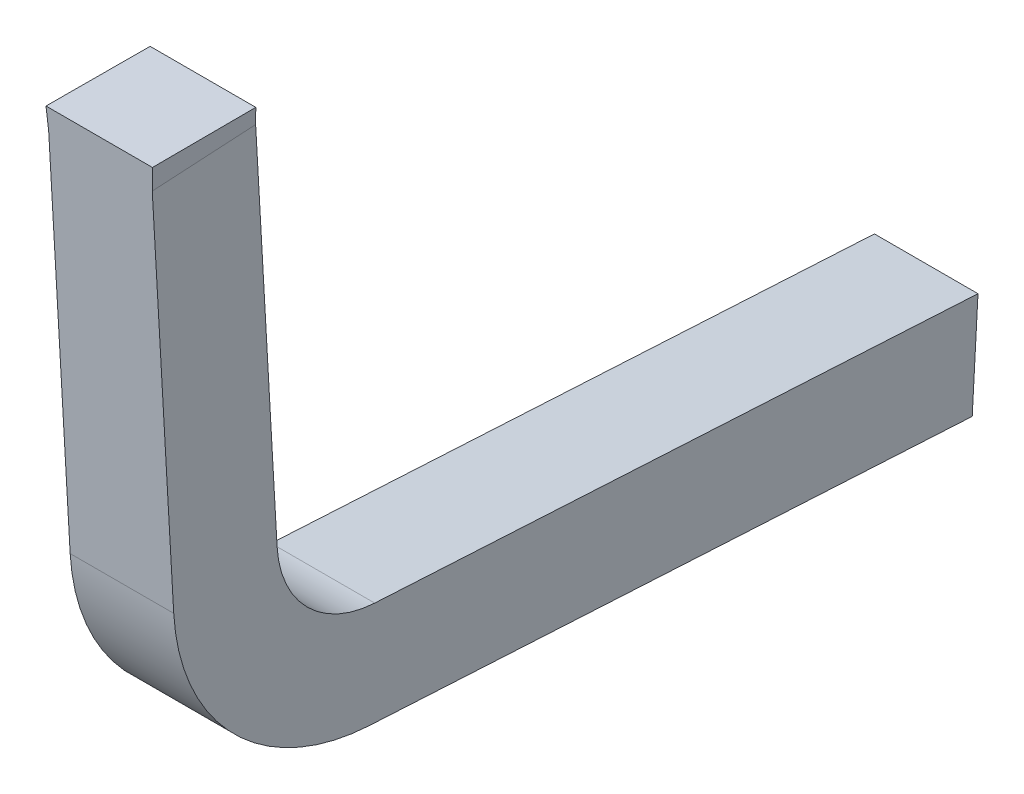
ISO-10303-21;
HEADER;
FILE_DESCRIPTION(('STEP AP214'),'2;1');
FILE_NAME('part.step','',(''),(''),'','','');
FILE_SCHEMA(('AUTOMOTIVE_DESIGN { 1 0 10303 214 1 1 1 1 }'));
ENDSEC;
DATA;
#1=APPLICATION_CONTEXT('core data for automotive mechanical design processes');
#2=APPLICATION_PROTOCOL_DEFINITION('international standard','automotive_design',2000,#1);
#3=PRODUCT_CONTEXT('',#1,'mechanical');
#4=PRODUCT('Part','Part','',(#3));
#5=PRODUCT_RELATED_PRODUCT_CATEGORY('part','',(#4));
#6=PRODUCT_DEFINITION_FORMATION('','',#4);
#7=PRODUCT_DEFINITION_CONTEXT('part definition',#1,'design');
#8=PRODUCT_DEFINITION('design','',#6,#7);
#9=PRODUCT_DEFINITION_SHAPE('','',#8);
#10=(LENGTH_UNIT() NAMED_UNIT(*) SI_UNIT(.MILLI.,.METRE.));
#11=(NAMED_UNIT(*) PLANE_ANGLE_UNIT() SI_UNIT($,.RADIAN.));
#12=(NAMED_UNIT(*) SI_UNIT($,.STERADIAN.) SOLID_ANGLE_UNIT());
#13=UNCERTAINTY_MEASURE_WITH_UNIT(LENGTH_MEASURE(1.E-05),#10,'distance_accuracy_value','');
#14=(GEOMETRIC_REPRESENTATION_CONTEXT(3) GLOBAL_UNCERTAINTY_ASSIGNED_CONTEXT((#13)) GLOBAL_UNIT_ASSIGNED_CONTEXT((#10,
#11,#12)) REPRESENTATION_CONTEXT('',''));
#15=CARTESIAN_POINT('',(0.,0.,0.));
#16=DIRECTION('',(0.,0.,1.));
#17=DIRECTION('',(1.,0.,0.));
#18=AXIS2_PLACEMENT_3D('',#15,#16,#17);
#19=CARTESIAN_POINT('',(-3.601406834182,-2.29897527843,-10.34781984343));
#20=DIRECTION('',(0.997785157857701,0.0664110878974701,0.003787632922693));
#21=DIRECTION('',(-0.0664115642747469,0.997792315129046,0.));
#22=AXIS2_PLACEMENT_3D('',#19,#20,#21);
#23=PLANE('',#22);
#24=DIRECTION('',(0.,-0.0569406083110753,0.998377567418842));
#25=VECTOR('',#24,1.);
#26=CARTESIAN_POINT('',(-3.6,-2.314349492935,-10.44885919008));
#27=LINE('',#26,#25);
#28=CARTESIAN_POINT('',(-3.6,-2.31434949293492,-10.4488591900814));
#29=VERTEX_POINT('',#28);
#30=CARTESIAN_POINT('',(-3.6,-2.32573761459728,-10.2491836765951));
#31=VERTEX_POINT('',#30);
#32=EDGE_CURVE('E98',#29,#31,#27,.T.);
#33=ORIENTED_EDGE('',*,*,#32,.T.);
#34=DIRECTION('',(0.0665190105147783,-0.996166318707982,-0.056814493854309));
#35=VECTOR('',#34,1.);
#36=CARTESIAN_POINT('',(-3.602813668365,-2.28360106392498,-10.2467804967704));
#37=LINE('',#36,#35);
#38=CARTESIAN_POINT('',(-3.602813668365,-2.28360106392499,-10.2467804967704));
#39=VERTEX_POINT('',#38);
#40=EDGE_CURVE('E148',#39,#31,#37,.T.);
#41=ORIENTED_EDGE('',*,*,#40,.F.);
#42=DIRECTION('',(-0.00379601320157547,0.,0.999992795115932));
#43=VECTOR('',#42,1.);
#44=CARTESIAN_POINT('',(-3.602053226489,-2.283601063925,-10.4471055106));
#45=LINE('',#44,#43);
#46=CARTESIAN_POINT('',(-3.602053226489,-2.28360106392489,-10.4471055106019));
#47=VERTEX_POINT('',#46);
#48=EDGE_CURVE('E161',#47,#39,#45,.T.);
#49=ORIENTED_EDGE('',*,*,#48,.F.);
#50=DIRECTION('',(0.0665190105273673,-0.996166318707226,-0.0568144938528306));
#51=VECTOR('',#50,1.);
#52=CARTESIAN_POINT('',(-3.602053226489,-2.28360106392483,-10.4471055106029));
#53=LINE('',#52,#51);
#54=EDGE_CURVE('E103',#47,#29,#53,.T.);
#55=ORIENTED_EDGE('',*,*,#54,.T.);
#56=EDGE_LOOP('',(#33,#41,#49,#55));
#57=FACE_BOUND('',#56,.T.);
#58=ADVANCED_FACE('F17',(#57),#23,.F.);
#59=CARTESIAN_POINT('',(-3.5,-2.283601063925,-10.34694300368));
#60=DIRECTION('',(0.,1.,0.));
#61=DIRECTION('',(0.,0.,1.));
#62=AXIS2_PLACEMENT_3D('',#59,#60,#61);
#63=PLANE('',#62);
#64=DIRECTION('',(1.,0.,0.));
#65=VECTOR('',#64,1.);
#66=CARTESIAN_POINT('',(-3.5,-2.28360106392498,-10.2467804967704));
#67=LINE('',#66,#65);
#68=CARTESIAN_POINT('',(-3.39718633163476,-2.283601063925,-10.2467804967704));
#69=VERTEX_POINT('',#68);
#70=EDGE_CURVE('E154',#69,#39,#67,.F.);
#71=ORIENTED_EDGE('',*,*,#70,.F.);
#72=DIRECTION('',(0.0037960132042621,-1.7968426456006E-13,0.999992795115921));
#73=VECTOR('',#72,1.);
#74=CARTESIAN_POINT('',(-3.3979467735108,-2.28360106392501,-10.4471055106));
#75=LINE('',#74,#73);
#76=CARTESIAN_POINT('',(-3.39794677351087,-2.28360106392495,-10.447105510601));
#77=VERTEX_POINT('',#76);
#78=EDGE_CURVE('E119',#77,#69,#75,.T.);
#79=ORIENTED_EDGE('',*,*,#78,.F.);
#80=DIRECTION('',(1.,0.,0.));
#81=VECTOR('',#80,1.);
#82=CARTESIAN_POINT('',(-3.5,-2.28360106392483,-10.4471055106029));
#83=LINE('',#82,#81);
#84=EDGE_CURVE('E125',#77,#47,#83,.F.);
#85=ORIENTED_EDGE('',*,*,#84,.T.);
#86=ORIENTED_EDGE('',*,*,#48,.T.);
#87=EDGE_LOOP('',(#71,#79,#85,#86));
#88=FACE_BOUND('',#87,.T.);
#89=ADVANCED_FACE('F243',(#88),#63,.T.);
#90=CARTESIAN_POINT('',(-3.6,-2.909472777839,-11.05227927458));
#91=DIRECTION('',(1.,0.,0.));
#92=DIRECTION('',(0.,0.,-1.));
#93=AXIS2_PLACEMENT_3D('',#90,#91,#92);
#94=PLANE('',#93);
#95=CARTESIAN_POINT('',(-3.6,-3.03,-10.69));
#96=DIRECTION('',(-1.,0.,0.));
#97=DIRECTION('',(0.,0.,1.));
#98=AXIS2_PLACEMENT_3D('',#95,#96,#97);
#99=CIRCLE('',#98,0.4);
#100=CARTESIAN_POINT('',(-3.6,-3.05277624331319,-10.2906489730306));
#101=VERTEX_POINT('',#100);
#102=CARTESIAN_POINT('',(-3.6,-3.42937693582933,-10.6676826720305));
#103=VERTEX_POINT('',#102);
#104=EDGE_CURVE('E142',#101,#103,#99,.F.);
#105=ORIENTED_EDGE('',*,*,#104,.F.);
#106=DIRECTION('',(0.,-0.998377567418718,-0.056940608313261));
#107=VECTOR('',#106,1.);
#108=CARTESIAN_POINT('',(-3.6,-2.668188653621,-10.2687147349));
#109=LINE('',#108,#107);
#110=EDGE_CURVE('E145',#31,#101,#109,.T.);
#111=ORIENTED_EDGE('',*,*,#110,.F.);
#112=ORIENTED_EDGE('',*,*,#32,.F.);
#113=DIRECTION('',(0.,-0.998377567418801,-0.0569406083117901));
#114=VECTOR('',#113,1.);
#115=CARTESIAN_POINT('',(-3.6,-2.662494592804,-10.46871499856));
#116=LINE('',#115,#114);
#117=CARTESIAN_POINT('',(-3.6,-3.04138812167726,-10.4903244865168));
#118=VERTEX_POINT('',#117);
#119=EDGE_CURVE('E92',#29,#118,#116,.T.);
#120=ORIENTED_EDGE('',*,*,#119,.T.);
#121=CARTESIAN_POINT('',(-3.6,-3.03,-10.69));
#122=DIRECTION('',(-1.,0.,0.));
#123=DIRECTION('',(0.,0.,1.));
#124=AXIS2_PLACEMENT_3D('',#121,#122,#123);
#125=CIRCLE('',#124,0.2);
#126=CARTESIAN_POINT('',(-3.6,-3.22968846791482,-10.6788413360177));
#127=VERTEX_POINT('',#126);
#128=EDGE_CURVE('E20',#118,#127,#125,.F.);
#129=ORIENTED_EDGE('',*,*,#128,.T.);
#130=DIRECTION('',(0.,0.0557933199228295,0.998442339572991));
#131=VECTOR('',#130,1.);
#132=CARTESIAN_POINT('',(-3.6,-3.262244863925,-11.26145022621));
#133=LINE('',#132,#131);
#134=CARTESIAN_POINT('',(-3.6,-3.29480125993501,-11.8440591164004));
#135=VERTEX_POINT('',#134);
#136=EDGE_CURVE('E111',#135,#127,#133,.T.);
#137=ORIENTED_EDGE('',*,*,#136,.F.);
#138=DIRECTION('',(0.,-0.998442339574031,0.0557933199042218));
#139=VECTOR('',#138,1.);
#140=CARTESIAN_POINT('',(-3.6,-3.394645493892,-11.83847978441));
#141=LINE('',#140,#139);
#142=CARTESIAN_POINT('',(-3.6,-3.49448972784906,-11.8329004524196));
#143=VERTEX_POINT('',#142);
#144=EDGE_CURVE('E135',#135,#143,#141,.T.);
#145=ORIENTED_EDGE('',*,*,#144,.T.);
#146=DIRECTION('',(0.,0.055793319922371,0.998442339573017));
#147=VECTOR('',#146,1.);
#148=CARTESIAN_POINT('',(-3.6,-3.461933331839,-11.25029156222));
#149=LINE('',#148,#147);
#150=EDGE_CURVE('E140',#143,#103,#149,.T.);
#151=ORIENTED_EDGE('',*,*,#150,.T.);
#152=EDGE_LOOP('',(#105,#111,#112,#120,#129,#137,#145,#151));
#153=FACE_BOUND('',#152,.T.);
#154=ADVANCED_FACE('F95',(#153),#94,.F.);
#155=CARTESIAN_POINT('',(-3.5,-3.262244863925,-11.26145022621));
#156=DIRECTION('',(0.,0.998442339572991,-0.0557933199228295));
#157=DIRECTION('',(0.,0.0557933199228295,0.998442339572991));
#158=AXIS2_PLACEMENT_3D('',#155,#156,#157);
#159=PLANE('',#158);
#160=DIRECTION('',(0.,0.055793319922887,0.998442339572988));
#161=VECTOR('',#160,1.);
#162=CARTESIAN_POINT('',(-3.4,-3.294801259935,-11.8440591164));
#163=LINE('',#162,#161);
#164=CARTESIAN_POINT('',(-3.4,-3.29480125993501,-11.8440591164001));
#165=VERTEX_POINT('',#164);
#166=CARTESIAN_POINT('',(-3.4,-3.2296884679148,-10.6788413360177));
#167=VERTEX_POINT('',#166);
#168=EDGE_CURVE('E129',#165,#167,#163,.T.);
#169=ORIENTED_EDGE('',*,*,#168,.F.);
#170=DIRECTION('',(1.,0.,0.));
#171=VECTOR('',#170,1.);
#172=CARTESIAN_POINT('',(-3.5,-3.29480125993502,-11.8440591164004));
#173=LINE('',#172,#171);
#174=EDGE_CURVE('E126',#165,#135,#173,.F.);
#175=ORIENTED_EDGE('',*,*,#174,.T.);
#176=ORIENTED_EDGE('',*,*,#136,.T.);
#177=DIRECTION('',(-1.,0.,0.));
#178=VECTOR('',#177,1.);
#179=CARTESIAN_POINT('',(-3.396,-3.22968846791485,-10.67884133602));
#180=LINE('',#179,#178);
#181=EDGE_CURVE('E110',#127,#167,#180,.F.);
#182=ORIENTED_EDGE('',*,*,#181,.T.);
#183=EDGE_LOOP('',(#169,#175,#176,#182));
#184=FACE_BOUND('',#183,.T.);
#185=ADVANCED_FACE('F234',(#184),#159,.T.);
#186=CARTESIAN_POINT('',(-3.396,-3.03,-10.69));
#187=DIRECTION('',(-1.,0.,0.));
#188=DIRECTION('',(0.,0.,1.));
#189=AXIS2_PLACEMENT_3D('',#186,#187,#188);
#190=CYLINDRICAL_SURFACE('',#189,0.2);
#191=ORIENTED_EDGE('',*,*,#128,.F.);
#192=DIRECTION('',(1.,0.,0.));
#193=VECTOR('',#192,1.);
#194=CARTESIAN_POINT('',(-3.5,-3.04138812169214,-10.4903244865176));
#195=LINE('',#194,#193);
#196=CARTESIAN_POINT('',(-3.4,-3.04138812167779,-10.490324486518));
#197=VERTEX_POINT('',#196);
#198=EDGE_CURVE('E102',#118,#197,#195,.T.);
#199=ORIENTED_EDGE('',*,*,#198,.T.);
#200=CARTESIAN_POINT('',(-3.4,-3.03,-10.69));
#201=DIRECTION('',(-1.,0.,0.));
#202=DIRECTION('',(0.,0.,1.));
#203=AXIS2_PLACEMENT_3D('',#200,#201,#202);
#204=CIRCLE('',#203,0.2);
#205=EDGE_CURVE('E185',#167,#197,#204,.T.);
#206=ORIENTED_EDGE('',*,*,#205,.F.);
#207=ORIENTED_EDGE('',*,*,#181,.F.);
#208=EDGE_LOOP('',(#191,#199,#206,#207));
#209=FACE_BOUND('',#208,.T.);
#210=ADVANCED_FACE('F107',(#209),#190,.F.);
#211=CARTESIAN_POINT('',(-3.5,-2.662494592804,-10.46871499856));
#212=DIRECTION('',(0.,-0.0569406083117901,0.998377567418801));
#213=DIRECTION('',(0.,-0.998377567418801,-0.0569406083117901));
#214=AXIS2_PLACEMENT_3D('',#211,#212,#213);
#215=PLANE('',#214);
#216=DIRECTION('',(0.,0.998377567418456,0.0569406083178453));
#217=VECTOR('',#216,1.);
#218=CARTESIAN_POINT('',(-3.4,-3.041388121692,-10.49032448652));
#219=LINE('',#218,#217);
#220=CARTESIAN_POINT('',(-3.39999999999992,-2.314349492934,-10.44885919008));
#221=VERTEX_POINT('',#220);
#222=EDGE_CURVE('E114',#197,#221,#219,.T.);
#223=ORIENTED_EDGE('',*,*,#222,.F.);
#224=ORIENTED_EDGE('',*,*,#198,.F.);
#225=ORIENTED_EDGE('',*,*,#119,.F.);
#226=ORIENTED_EDGE('',*,*,#54,.F.);
#227=ORIENTED_EDGE('',*,*,#84,.F.);
#228=DIRECTION('',(0.0665190105284185,0.996166318705548,0.0568144938810224));
#229=VECTOR('',#228,1.);
#230=CARTESIAN_POINT('',(-3.39999999999977,-2.31434949293401,-10.44885919008));
#231=LINE('',#230,#229);
#232=EDGE_CURVE('E116',#221,#77,#231,.T.);
#233=ORIENTED_EDGE('',*,*,#232,.F.);
#234=EDGE_LOOP('',(#223,#224,#225,#226,#227,#233));
#235=FACE_BOUND('',#234,.T.);
#236=ADVANCED_FACE('F112',(#235),#215,.F.);
#237=CARTESIAN_POINT('',(-3.398593165817,-2.298975278429,-10.34781984343));
#238=DIRECTION('',(0.9977851578563,-0.06641108791847,-0.003787632923708));
#239=DIRECTION('',(0.0664115642957472,0.997792315127648,0.));
#240=AXIS2_PLACEMENT_3D('',#237,#238,#239);
#241=PLANE('',#240);
#242=ORIENTED_EDGE('',*,*,#232,.T.);
#243=ORIENTED_EDGE('',*,*,#78,.T.);
#244=DIRECTION('',(0.0665190105179116,0.996166318707773,0.0568144938543194));
#245=VECTOR('',#244,1.);
#246=CARTESIAN_POINT('',(-3.4,-2.32573761459528,-10.249183676595));
#247=LINE('',#246,#245);
#248=CARTESIAN_POINT('',(-3.4,-2.32573761459509,-10.2491836765983));
#249=VERTEX_POINT('',#248);
#250=EDGE_CURVE('E147',#249,#69,#247,.T.);
#251=ORIENTED_EDGE('',*,*,#250,.F.);
#252=DIRECTION('',(0.,-0.0569406083060912,0.998377567419126));
#253=VECTOR('',#252,1.);
#254=CARTESIAN_POINT('',(-3.4,-2.314349492934,-10.44885919008));
#255=LINE('',#254,#253);
#256=EDGE_CURVE('E200',#221,#249,#255,.T.);
#257=ORIENTED_EDGE('',*,*,#256,.F.);
#258=EDGE_LOOP('',(#242,#243,#251,#257));
#259=FACE_BOUND('',#258,.T.);
#260=ADVANCED_FACE('F258',(#259),#241,.T.);
#261=CARTESIAN_POINT('',(-3.5,-2.668188653621,-10.2687147349));
#262=DIRECTION('',(0.,-0.056940608313261,0.998377567418718));
#263=DIRECTION('',(0.,-0.998377567418718,-0.056940608313261));
#264=AXIS2_PLACEMENT_3D('',#261,#262,#263);
#265=PLANE('',#264);
#266=ORIENTED_EDGE('',*,*,#250,.T.);
#267=ORIENTED_EDGE('',*,*,#70,.T.);
#268=ORIENTED_EDGE('',*,*,#40,.T.);
#269=ORIENTED_EDGE('',*,*,#110,.T.);
#270=DIRECTION('',(-1.,0.,0.));
#271=VECTOR('',#270,1.);
#272=CARTESIAN_POINT('',(-3.396,-3.05277624330094,-10.2906489730311));
#273=LINE('',#272,#271);
#274=CARTESIAN_POINT('',(-3.4,-3.05277624331214,-10.2906489730312));
#275=VERTEX_POINT('',#274);
#276=EDGE_CURVE('E157',#275,#101,#273,.T.);
#277=ORIENTED_EDGE('',*,*,#276,.F.);
#278=DIRECTION('',(0.,-0.998377567419005,-0.0569406083082185));
#279=VECTOR('',#278,1.);
#280=CARTESIAN_POINT('',(-3.4,-2.325737614595,-10.2491836766));
#281=LINE('',#280,#279);
#282=EDGE_CURVE('E184',#249,#275,#281,.T.);
#283=ORIENTED_EDGE('',*,*,#282,.F.);
#284=EDGE_LOOP('',(#266,#267,#268,#269,#277,#283));
#285=FACE_BOUND('',#284,.T.);
#286=ADVANCED_FACE('F227',(#285),#265,.T.);
#287=CARTESIAN_POINT('',(-3.396,-3.03,-10.69));
#288=DIRECTION('',(-1.,0.,0.));
#289=DIRECTION('',(0.,0.,1.));
#290=AXIS2_PLACEMENT_3D('',#287,#288,#289);
#291=CYLINDRICAL_SURFACE('',#290,0.4);
#292=DIRECTION('',(1.,0.,0.));
#293=VECTOR('',#292,1.);
#294=CARTESIAN_POINT('',(-3.5,-3.4293769358293,-10.66768267203));
#295=LINE('',#294,#293);
#296=CARTESIAN_POINT('',(-3.4,-3.42937693582946,-10.6676826720306));
#297=VERTEX_POINT('',#296);
#298=EDGE_CURVE('E137',#103,#297,#295,.T.);
#299=ORIENTED_EDGE('',*,*,#298,.T.);
#300=CARTESIAN_POINT('',(-3.4,-3.03,-10.69));
#301=DIRECTION('',(-1.,0.,0.));
#302=DIRECTION('',(0.,0.,1.));
#303=AXIS2_PLACEMENT_3D('',#300,#301,#302);
#304=CIRCLE('',#303,0.4);
#305=EDGE_CURVE('E181',#275,#297,#304,.F.);
#306=ORIENTED_EDGE('',*,*,#305,.F.);
#307=ORIENTED_EDGE('',*,*,#276,.T.);
#308=ORIENTED_EDGE('',*,*,#104,.T.);
#309=EDGE_LOOP('',(#299,#306,#307,#308));
#310=FACE_BOUND('',#309,.T.);
#311=ADVANCED_FACE('F220',(#310),#291,.T.);
#312=CARTESIAN_POINT('',(-3.5,-3.461933331839,-11.25029156222));
#313=DIRECTION('',(0.,0.998442339573017,-0.055793319922371));
#314=DIRECTION('',(0.,0.055793319922371,0.998442339573017));
#315=AXIS2_PLACEMENT_3D('',#312,#313,#314);
#316=PLANE('',#315);
#317=ORIENTED_EDGE('',*,*,#298,.F.);
#318=ORIENTED_EDGE('',*,*,#150,.F.);
#319=DIRECTION('',(1.,0.,0.));
#320=VECTOR('',#319,1.);
#321=CARTESIAN_POINT('',(-3.5,-3.49448972784898,-11.8329004524196));
#322=LINE('',#321,#320);
#323=CARTESIAN_POINT('',(-3.4,-3.49448972784899,-11.8329004524199));
#324=VERTEX_POINT('',#323);
#325=EDGE_CURVE('E35',#143,#324,#322,.T.);
#326=ORIENTED_EDGE('',*,*,#325,.T.);
#327=DIRECTION('',(0.,-0.0557933199219327,-0.998442339573042));
#328=VECTOR('',#327,1.);
#329=CARTESIAN_POINT('',(-3.4,-3.429376935829,-10.66768267202));
#330=LINE('',#329,#328);
#331=EDGE_CURVE('E26',#297,#324,#330,.T.);
#332=ORIENTED_EDGE('',*,*,#331,.F.);
#333=EDGE_LOOP('',(#317,#318,#326,#332));
#334=FACE_BOUND('',#333,.T.);
#335=ADVANCED_FACE('F222',(#334),#316,.F.);
#336=CARTESIAN_POINT('',(-3.5,-3.394645493892,-11.83847978441));
#337=DIRECTION('',(0.,0.0557933199042218,0.998442339574031));
#338=DIRECTION('',(0.,-0.998442339574031,0.0557933199042218));
#339=AXIS2_PLACEMENT_3D('',#336,#337,#338);
#340=PLANE('',#339);
#341=DIRECTION('',(0.,0.998442339574254,-0.0557933199002383));
#342=VECTOR('',#341,1.);
#343=CARTESIAN_POINT('',(-3.4,-3.494489727849,-11.83290045242));
#344=LINE('',#343,#342);
#345=EDGE_CURVE('E11',#324,#165,#344,.T.);
#346=ORIENTED_EDGE('',*,*,#345,.F.);
#347=ORIENTED_EDGE('',*,*,#325,.F.);
#348=ORIENTED_EDGE('',*,*,#144,.F.);
#349=ORIENTED_EDGE('',*,*,#174,.F.);
#350=EDGE_LOOP('',(#346,#347,#348,#349));
#351=FACE_BOUND('',#350,.T.);
#352=ADVANCED_FACE('F230',(#351),#340,.F.);
#353=CARTESIAN_POINT('',(-3.4,-2.909472777838,-11.05227927458));
#354=DIRECTION('',(1.,0.,0.));
#355=DIRECTION('',(0.,0.,-1.));
#356=AXIS2_PLACEMENT_3D('',#353,#354,#355);
#357=PLANE('',#356);
#358=ORIENTED_EDGE('',*,*,#331,.T.);
#359=ORIENTED_EDGE('',*,*,#345,.T.);
#360=ORIENTED_EDGE('',*,*,#168,.T.);
#361=ORIENTED_EDGE('',*,*,#205,.T.);
#362=ORIENTED_EDGE('',*,*,#222,.T.);
#363=ORIENTED_EDGE('',*,*,#256,.T.);
#364=ORIENTED_EDGE('',*,*,#282,.T.);
#365=ORIENTED_EDGE('',*,*,#305,.T.);
#366=EDGE_LOOP('',(#358,#359,#360,#361,#362,#363,#364,#365));
#367=FACE_BOUND('',#366,.T.);
#368=ADVANCED_FACE('F224',(#367),#357,.T.);
#369=CLOSED_SHELL('',(#58,#89,#154,#185,#210,#236,#260,#286,#311,#335,#352,#368));
#370=MANIFOLD_SOLID_BREP('B1',#369);
#371=ADVANCED_BREP_SHAPE_REPRESENTATION('',(#18,#370),#14);
#372=SHAPE_DEFINITION_REPRESENTATION(#9,#371);
ENDSEC;
END-ISO-10303-21;
